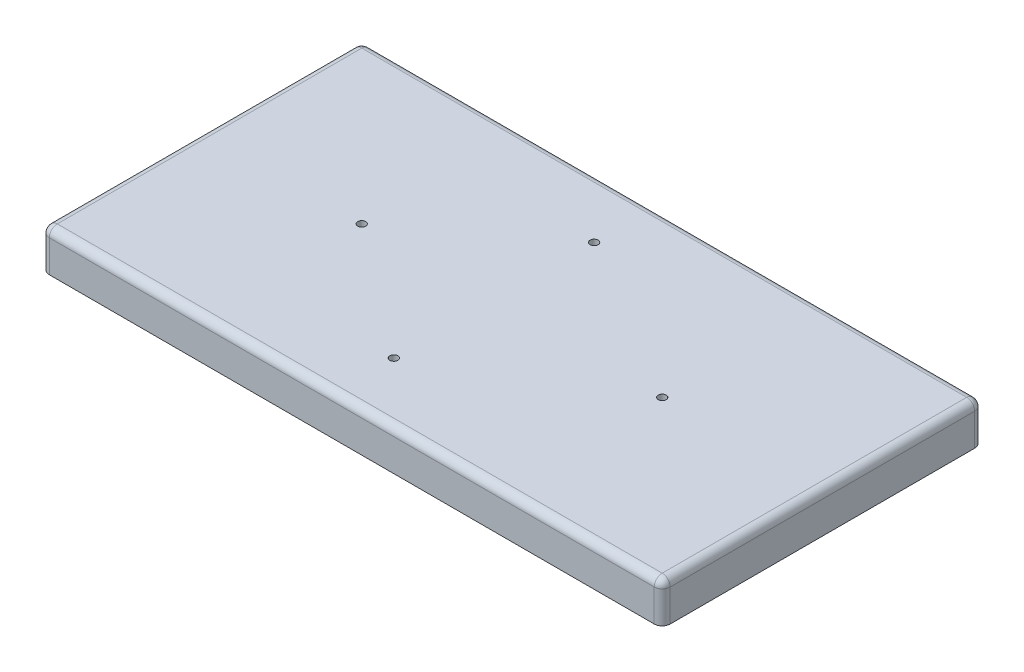
ISO-10303-21;
HEADER;
FILE_DESCRIPTION(('STEP AP214'),'2;1');
FILE_NAME('part.step','',(''),(''),'','','');
FILE_SCHEMA(('AUTOMOTIVE_DESIGN { 1 0 10303 214 1 1 1 1 }'));
ENDSEC;
DATA;
#1=APPLICATION_CONTEXT('core data for automotive mechanical design processes');
#2=APPLICATION_PROTOCOL_DEFINITION('international standard','automotive_design',2000,#1);
#3=PRODUCT_CONTEXT('',#1,'mechanical');
#4=PRODUCT('Part','Part','',(#3));
#5=PRODUCT_RELATED_PRODUCT_CATEGORY('part','',(#4));
#6=PRODUCT_DEFINITION_FORMATION('','',#4);
#7=PRODUCT_DEFINITION_CONTEXT('part definition',#1,'design');
#8=PRODUCT_DEFINITION('design','',#6,#7);
#9=PRODUCT_DEFINITION_SHAPE('','',#8);
#10=(LENGTH_UNIT() NAMED_UNIT(*) SI_UNIT(.MILLI.,.METRE.));
#11=(NAMED_UNIT(*) PLANE_ANGLE_UNIT() SI_UNIT($,.RADIAN.));
#12=(NAMED_UNIT(*) SI_UNIT($,.STERADIAN.) SOLID_ANGLE_UNIT());
#13=UNCERTAINTY_MEASURE_WITH_UNIT(LENGTH_MEASURE(1.E-05),#10,'distance_accuracy_value','');
#14=(GEOMETRIC_REPRESENTATION_CONTEXT(3) GLOBAL_UNCERTAINTY_ASSIGNED_CONTEXT((#13)) GLOBAL_UNIT_ASSIGNED_CONTEXT((#10,
#11,#12)) REPRESENTATION_CONTEXT('',''));
#15=CARTESIAN_POINT('',(0.,0.,0.));
#16=DIRECTION('',(0.,0.,1.));
#17=DIRECTION('',(1.,0.,0.));
#18=AXIS2_PLACEMENT_3D('',#15,#16,#17);
#19=CARTESIAN_POINT('',(0.,-5.,0.));
#20=DIRECTION('',(0.,-1.,0.));
#21=DIRECTION('',(0.,0.,-1.));
#22=AXIS2_PLACEMENT_3D('',#19,#20,#21);
#23=PLANE('',#22);
#24=CARTESIAN_POINT('',(73.,-5.,-15.));
#25=DIRECTION('',(0.,1.,0.));
#26=DIRECTION('',(0.,0.,1.));
#27=AXIS2_PLACEMENT_3D('',#24,#25,#26);
#28=CIRCLE('',#27,0.999999999999998);
#29=CARTESIAN_POINT('',(73.,-5.,-14.));
#30=VERTEX_POINT('',#29);
#31=EDGE_CURVE('E283',#30,#30,#28,.T.);
#32=ORIENTED_EDGE('',*,*,#31,.T.);
#33=EDGE_LOOP('',(#32));
#34=FACE_BOUND('',#33,.T.);
#35=CARTESIAN_POINT('',(73.,-5.,-65.));
#36=DIRECTION('',(0.,1.,0.));
#37=DIRECTION('',(0.,0.,1.));
#38=AXIS2_PLACEMENT_3D('',#35,#36,#37);
#39=CIRCLE('',#38,0.999999999999998);
#40=CARTESIAN_POINT('',(73.,-5.,-64.));
#41=VERTEX_POINT('',#40);
#42=EDGE_CURVE('E291',#41,#41,#39,.T.);
#43=ORIENTED_EDGE('',*,*,#42,.T.);
#44=EDGE_LOOP('',(#43));
#45=FACE_BOUND('',#44,.T.);
#46=CARTESIAN_POINT('',(115.,-5.,-40.));
#47=DIRECTION('',(0.,1.,0.));
#48=DIRECTION('',(0.,0.,1.));
#49=AXIS2_PLACEMENT_3D('',#46,#47,#48);
#50=CIRCLE('',#49,0.999999999999998);
#51=CARTESIAN_POINT('',(115.,-5.,-39.));
#52=VERTEX_POINT('',#51);
#53=EDGE_CURVE('E299',#52,#52,#50,.T.);
#54=ORIENTED_EDGE('',*,*,#53,.T.);
#55=EDGE_LOOP('',(#54));
#56=FACE_BOUND('',#55,.T.);
#57=CARTESIAN_POINT('',(40.,-5.,-40.));
#58=DIRECTION('',(0.,1.,0.));
#59=DIRECTION('',(0.,0.,1.));
#60=AXIS2_PLACEMENT_3D('',#57,#58,#59);
#61=CIRCLE('',#60,0.999999999999998);
#62=CARTESIAN_POINT('',(40.,-5.,-39.));
#63=VERTEX_POINT('',#62);
#64=EDGE_CURVE('E307',#63,#63,#61,.T.);
#65=ORIENTED_EDGE('',*,*,#64,.T.);
#66=EDGE_LOOP('',(#65));
#67=FACE_BOUND('',#66,.T.);
#68=DIRECTION('',(-1.,0.,0.));
#69=VECTOR('',#68,1.);
#70=CARTESIAN_POINT('',(0.,-5.,-5.));
#71=LINE('',#70,#69);
#72=CARTESIAN_POINT('',(150.,-5.,-5.));
#73=VERTEX_POINT('',#72);
#74=CARTESIAN_POINT('',(5.00000000000001,-5.,-5.));
#75=VERTEX_POINT('',#74);
#76=EDGE_CURVE('E223',#73,#75,#71,.T.);
#77=ORIENTED_EDGE('',*,*,#76,.T.);
#78=DIRECTION('',(0.,0.,-1.));
#79=VECTOR('',#78,1.);
#80=CARTESIAN_POINT('',(5.00000000000001,-5.,0.));
#81=LINE('',#80,#79);
#82=CARTESIAN_POINT('',(5.,-5.,-75.));
#83=VERTEX_POINT('',#82);
#84=EDGE_CURVE('E172',#75,#83,#81,.T.);
#85=ORIENTED_EDGE('',*,*,#84,.T.);
#86=DIRECTION('',(1.,0.,0.));
#87=VECTOR('',#86,1.);
#88=CARTESIAN_POINT('',(0.,-5.,-75.));
#89=LINE('',#88,#87);
#90=CARTESIAN_POINT('',(150.,-5.,-75.));
#91=VERTEX_POINT('',#90);
#92=EDGE_CURVE('E230',#83,#91,#89,.T.);
#93=ORIENTED_EDGE('',*,*,#92,.T.);
#94=DIRECTION('',(0.,0.,1.));
#95=VECTOR('',#94,1.);
#96=CARTESIAN_POINT('',(150.,-5.,0.));
#97=LINE('',#96,#95);
#98=EDGE_CURVE('E226',#91,#73,#97,.T.);
#99=ORIENTED_EDGE('',*,*,#98,.T.);
#100=EDGE_LOOP('',(#77,#85,#93,#99));
#101=FACE_BOUND('',#100,.T.);
#102=ADVANCED_FACE('F39',(#34,#45,#56,#67,#101),#23,.T.);
#103=CARTESIAN_POINT('',(3.,-10.,-77.));
#104=DIRECTION('',(-1.,0.,0.));
#105=DIRECTION('',(0.,0.,1.));
#106=AXIS2_PLACEMENT_3D('',#103,#104,#105);
#107=PLANE('',#106);
#108=DIRECTION('',(0.,0.,-1.));
#109=VECTOR('',#108,1.);
#110=CARTESIAN_POINT('',(3.,-7.,-77.));
#111=LINE('',#110,#109);
#112=CARTESIAN_POINT('',(3.00000000000001,-7.,-3.));
#113=VERTEX_POINT('',#112);
#114=CARTESIAN_POINT('',(3.,-7.,-77.));
#115=VERTEX_POINT('',#114);
#116=EDGE_CURVE('E219',#113,#115,#111,.T.);
#117=ORIENTED_EDGE('',*,*,#116,.F.);
#118=DIRECTION('',(0.,1.,0.));
#119=VECTOR('',#118,1.);
#120=CARTESIAN_POINT('',(3.00000000000001,-10.,-3.));
#121=LINE('',#120,#119);
#122=CARTESIAN_POINT('',(3.00000000000001,-10.,-3.));
#123=VERTEX_POINT('',#122);
#124=EDGE_CURVE('E252',#123,#113,#121,.T.);
#125=ORIENTED_EDGE('',*,*,#124,.F.);
#126=DIRECTION('',(0.,0.,1.));
#127=VECTOR('',#126,1.);
#128=CARTESIAN_POINT('',(3.,-10.,-77.));
#129=LINE('',#128,#127);
#130=CARTESIAN_POINT('',(3.,-10.,-77.));
#131=VERTEX_POINT('',#130);
#132=EDGE_CURVE('E236',#131,#123,#129,.T.);
#133=ORIENTED_EDGE('',*,*,#132,.F.);
#134=DIRECTION('',(0.,1.,0.));
#135=VECTOR('',#134,1.);
#136=CARTESIAN_POINT('',(3.,-10.,-77.));
#137=LINE('',#136,#135);
#138=EDGE_CURVE('E253',#131,#115,#137,.T.);
#139=ORIENTED_EDGE('',*,*,#138,.T.);
#140=EDGE_LOOP('',(#117,#125,#133,#139));
#141=FACE_BOUND('',#140,.T.);
#142=ADVANCED_FACE('F493',(#141),#107,.F.);
#143=CARTESIAN_POINT('',(3.,-10.,-77.));
#144=DIRECTION('',(0.,0.,-1.));
#145=DIRECTION('',(-1.,0.,0.));
#146=AXIS2_PLACEMENT_3D('',#143,#144,#145);
#147=PLANE('',#146);
#148=DIRECTION('',(1.,0.,0.));
#149=VECTOR('',#148,1.);
#150=CARTESIAN_POINT('',(3.,-7.,-77.));
#151=LINE('',#150,#149);
#152=CARTESIAN_POINT('',(152.,-7.,-77.));
#153=VERTEX_POINT('',#152);
#154=EDGE_CURVE('E215',#115,#153,#151,.T.);
#155=ORIENTED_EDGE('',*,*,#154,.F.);
#156=ORIENTED_EDGE('',*,*,#138,.F.);
#157=DIRECTION('',(-1.,0.,0.));
#158=VECTOR('',#157,1.);
#159=CARTESIAN_POINT('',(3.,-10.,-77.));
#160=LINE('',#159,#158);
#161=CARTESIAN_POINT('',(152.,-10.,-77.));
#162=VERTEX_POINT('',#161);
#163=EDGE_CURVE('E248',#162,#131,#160,.T.);
#164=ORIENTED_EDGE('',*,*,#163,.F.);
#165=DIRECTION('',(0.,1.,0.));
#166=VECTOR('',#165,1.);
#167=CARTESIAN_POINT('',(152.,-10.,-77.));
#168=LINE('',#167,#166);
#169=EDGE_CURVE('E258',#162,#153,#168,.T.);
#170=ORIENTED_EDGE('',*,*,#169,.T.);
#171=EDGE_LOOP('',(#155,#156,#164,#170));
#172=FACE_BOUND('',#171,.T.);
#173=ADVANCED_FACE('F499',(#172),#147,.F.);
#174=CARTESIAN_POINT('',(152.,-10.,-77.));
#175=DIRECTION('',(1.,0.,0.));
#176=DIRECTION('',(0.,0.,-1.));
#177=AXIS2_PLACEMENT_3D('',#174,#175,#176);
#178=PLANE('',#177);
#179=DIRECTION('',(0.,0.,1.));
#180=VECTOR('',#179,1.);
#181=CARTESIAN_POINT('',(152.,-7.,-77.));
#182=LINE('',#181,#180);
#183=CARTESIAN_POINT('',(152.,-7.,-3.));
#184=VERTEX_POINT('',#183);
#185=EDGE_CURVE('E205',#153,#184,#182,.T.);
#186=ORIENTED_EDGE('',*,*,#185,.F.);
#187=ORIENTED_EDGE('',*,*,#169,.F.);
#188=DIRECTION('',(0.,0.,-1.));
#189=VECTOR('',#188,1.);
#190=CARTESIAN_POINT('',(152.,-10.,-77.));
#191=LINE('',#190,#189);
#192=CARTESIAN_POINT('',(152.,-10.,-3.));
#193=VERTEX_POINT('',#192);
#194=EDGE_CURVE('E244',#193,#162,#191,.T.);
#195=ORIENTED_EDGE('',*,*,#194,.F.);
#196=DIRECTION('',(0.,1.,0.));
#197=VECTOR('',#196,1.);
#198=CARTESIAN_POINT('',(152.,-10.,-3.));
#199=LINE('',#198,#197);
#200=EDGE_CURVE('E262',#193,#184,#199,.T.);
#201=ORIENTED_EDGE('',*,*,#200,.T.);
#202=EDGE_LOOP('',(#186,#187,#195,#201));
#203=FACE_BOUND('',#202,.T.);
#204=ADVANCED_FACE('F514',(#203),#178,.F.);
#205=CARTESIAN_POINT('',(3.00000000000001,-10.,-3.));
#206=DIRECTION('',(0.,0.,1.));
#207=DIRECTION('',(1.,0.,0.));
#208=AXIS2_PLACEMENT_3D('',#205,#206,#207);
#209=PLANE('',#208);
#210=DIRECTION('',(-1.,0.,0.));
#211=VECTOR('',#210,1.);
#212=CARTESIAN_POINT('',(3.00000000000001,-7.,-3.));
#213=LINE('',#212,#211);
#214=EDGE_CURVE('E311',#184,#113,#213,.T.);
#215=ORIENTED_EDGE('',*,*,#214,.F.);
#216=ORIENTED_EDGE('',*,*,#200,.F.);
#217=DIRECTION('',(1.,0.,0.));
#218=VECTOR('',#217,1.);
#219=CARTESIAN_POINT('',(3.00000000000001,-10.,-3.));
#220=LINE('',#219,#218);
#221=EDGE_CURVE('E240',#123,#193,#220,.T.);
#222=ORIENTED_EDGE('',*,*,#221,.F.);
#223=ORIENTED_EDGE('',*,*,#124,.T.);
#224=EDGE_LOOP('',(#215,#216,#222,#223));
#225=FACE_BOUND('',#224,.T.);
#226=ADVANCED_FACE('F510',(#225),#209,.F.);
#227=CARTESIAN_POINT('',(0.,-5.,0.));
#228=DIRECTION('',(-1.,0.,0.));
#229=DIRECTION('',(0.,0.,1.));
#230=AXIS2_PLACEMENT_3D('',#227,#228,#229);
#231=PLANE('',#230);
#232=DIRECTION('',(0.,0.,1.));
#233=VECTOR('',#232,1.);
#234=CARTESIAN_POINT('',(0.,-2.,-80.));
#235=LINE('',#234,#233);
#236=CARTESIAN_POINT('',(0.,-2.,-2.));
#237=VERTEX_POINT('',#236);
#238=CARTESIAN_POINT('',(0.,-2.,-78.));
#239=VERTEX_POINT('',#238);
#240=EDGE_CURVE('E49',#237,#239,#235,.F.);
#241=ORIENTED_EDGE('',*,*,#240,.T.);
#242=DIRECTION('',(0.,1.,0.));
#243=VECTOR('',#242,1.);
#244=CARTESIAN_POINT('',(0.,-5.,-78.));
#245=LINE('',#244,#243);
#246=CARTESIAN_POINT('',(0.,-10.,-78.));
#247=VERTEX_POINT('',#246);
#248=EDGE_CURVE('E11',#239,#247,#245,.F.);
#249=ORIENTED_EDGE('',*,*,#248,.T.);
#250=DIRECTION('',(0.,0.,1.));
#251=VECTOR('',#250,1.);
#252=CARTESIAN_POINT('',(0.,-10.,-80.));
#253=LINE('',#252,#251);
#254=CARTESIAN_POINT('',(0.,-10.,-2.));
#255=VERTEX_POINT('',#254);
#256=EDGE_CURVE('E257',#247,#255,#253,.T.);
#257=ORIENTED_EDGE('',*,*,#256,.T.);
#258=DIRECTION('',(0.,1.,0.));
#259=VECTOR('',#258,1.);
#260=CARTESIAN_POINT('',(0.,-5.,-2.));
#261=LINE('',#260,#259);
#262=EDGE_CURVE('E60',#255,#237,#261,.T.);
#263=ORIENTED_EDGE('',*,*,#262,.T.);
#264=EDGE_LOOP('',(#241,#249,#257,#263));
#265=FACE_BOUND('',#264,.T.);
#266=ADVANCED_FACE('F429',(#265),#231,.T.);
#267=CARTESIAN_POINT('',(0.,-5.,-80.));
#268=DIRECTION('',(0.,0.,-1.));
#269=DIRECTION('',(-1.,0.,0.));
#270=AXIS2_PLACEMENT_3D('',#267,#268,#269);
#271=PLANE('',#270);
#272=DIRECTION('',(-1.,0.,0.));
#273=VECTOR('',#272,1.);
#274=CARTESIAN_POINT('',(155.,-2.,-80.));
#275=LINE('',#274,#273);
#276=CARTESIAN_POINT('',(2.,-2.,-80.));
#277=VERTEX_POINT('',#276);
#278=CARTESIAN_POINT('',(153.,-2.,-80.));
#279=VERTEX_POINT('',#278);
#280=EDGE_CURVE('E365',#277,#279,#275,.F.);
#281=ORIENTED_EDGE('',*,*,#280,.T.);
#282=DIRECTION('',(0.,1.,0.));
#283=VECTOR('',#282,1.);
#284=CARTESIAN_POINT('',(153.,-5.,-80.));
#285=LINE('',#284,#283);
#286=CARTESIAN_POINT('',(153.,-10.,-80.));
#287=VERTEX_POINT('',#286);
#288=EDGE_CURVE('E368',#279,#287,#285,.F.);
#289=ORIENTED_EDGE('',*,*,#288,.T.);
#290=DIRECTION('',(-1.,0.,0.));
#291=VECTOR('',#290,1.);
#292=CARTESIAN_POINT('',(0.,-10.,-80.));
#293=LINE('',#292,#291);
#294=CARTESIAN_POINT('',(2.,-10.,-80.));
#295=VERTEX_POINT('',#294);
#296=EDGE_CURVE('E278',#287,#295,#293,.T.);
#297=ORIENTED_EDGE('',*,*,#296,.T.);
#298=DIRECTION('',(0.,1.,0.));
#299=VECTOR('',#298,1.);
#300=CARTESIAN_POINT('',(2.,-5.,-80.));
#301=LINE('',#300,#299);
#302=EDGE_CURVE('E362',#295,#277,#301,.T.);
#303=ORIENTED_EDGE('',*,*,#302,.T.);
#304=EDGE_LOOP('',(#281,#289,#297,#303));
#305=FACE_BOUND('',#304,.T.);
#306=ADVANCED_FACE('F466',(#305),#271,.T.);
#307=CARTESIAN_POINT('',(155.,-5.,0.));
#308=DIRECTION('',(1.,0.,0.));
#309=DIRECTION('',(0.,0.,-1.));
#310=AXIS2_PLACEMENT_3D('',#307,#308,#309);
#311=PLANE('',#310);
#312=DIRECTION('',(0.,0.,-1.));
#313=VECTOR('',#312,1.);
#314=CARTESIAN_POINT('',(155.,-2.,0.));
#315=LINE('',#314,#313);
#316=CARTESIAN_POINT('',(155.,-2.,-78.));
#317=VERTEX_POINT('',#316);
#318=CARTESIAN_POINT('',(155.,-2.,-2.));
#319=VERTEX_POINT('',#318);
#320=EDGE_CURVE('E331',#317,#319,#315,.F.);
#321=ORIENTED_EDGE('',*,*,#320,.T.);
#322=DIRECTION('',(0.,1.,0.));
#323=VECTOR('',#322,1.);
#324=CARTESIAN_POINT('',(155.,-5.,-2.));
#325=LINE('',#324,#323);
#326=CARTESIAN_POINT('',(155.,-10.,-2.));
#327=VERTEX_POINT('',#326);
#328=EDGE_CURVE('E334',#319,#327,#325,.F.);
#329=ORIENTED_EDGE('',*,*,#328,.T.);
#330=DIRECTION('',(0.,0.,-1.));
#331=VECTOR('',#330,1.);
#332=CARTESIAN_POINT('',(155.,-10.,-80.));
#333=LINE('',#332,#331);
#334=CARTESIAN_POINT('',(155.,-10.,-78.));
#335=VERTEX_POINT('',#334);
#336=EDGE_CURVE('E274',#327,#335,#333,.T.);
#337=ORIENTED_EDGE('',*,*,#336,.T.);
#338=DIRECTION('',(0.,1.,0.));
#339=VECTOR('',#338,1.);
#340=CARTESIAN_POINT('',(155.,-5.,-78.));
#341=LINE('',#340,#339);
#342=EDGE_CURVE('E328',#335,#317,#341,.T.);
#343=ORIENTED_EDGE('',*,*,#342,.T.);
#344=EDGE_LOOP('',(#321,#329,#337,#343));
#345=FACE_BOUND('',#344,.T.);
#346=ADVANCED_FACE('F473',(#345),#311,.T.);
#347=CARTESIAN_POINT('',(0.,-5.,0.));
#348=DIRECTION('',(0.,0.,1.));
#349=DIRECTION('',(1.,0.,0.));
#350=AXIS2_PLACEMENT_3D('',#347,#348,#349);
#351=PLANE('',#350);
#352=DIRECTION('',(1.,0.,0.));
#353=VECTOR('',#352,1.);
#354=CARTESIAN_POINT('',(0.,-10.,0.));
#355=LINE('',#354,#353);
#356=CARTESIAN_POINT('',(2.,-10.,0.));
#357=VERTEX_POINT('',#356);
#358=CARTESIAN_POINT('',(153.,-10.,0.));
#359=VERTEX_POINT('',#358);
#360=EDGE_CURVE('E270',#357,#359,#355,.T.);
#361=ORIENTED_EDGE('',*,*,#360,.T.);
#362=DIRECTION('',(0.,1.,0.));
#363=VECTOR('',#362,1.);
#364=CARTESIAN_POINT('',(153.,-5.,0.));
#365=LINE('',#364,#363);
#366=CARTESIAN_POINT('',(153.,-2.,0.));
#367=VERTEX_POINT('',#366);
#368=EDGE_CURVE('E324',#359,#367,#365,.T.);
#369=ORIENTED_EDGE('',*,*,#368,.T.);
#370=DIRECTION('',(1.,0.,0.));
#371=VECTOR('',#370,1.);
#372=CARTESIAN_POINT('',(0.,-2.,0.));
#373=LINE('',#372,#371);
#374=CARTESIAN_POINT('',(2.,-2.,0.));
#375=VERTEX_POINT('',#374);
#376=EDGE_CURVE('E318',#367,#375,#373,.F.);
#377=ORIENTED_EDGE('',*,*,#376,.T.);
#378=DIRECTION('',(0.,1.,0.));
#379=VECTOR('',#378,1.);
#380=CARTESIAN_POINT('',(2.,-5.,0.));
#381=LINE('',#380,#379);
#382=EDGE_CURVE('E321',#375,#357,#381,.F.);
#383=ORIENTED_EDGE('',*,*,#382,.T.);
#384=EDGE_LOOP('',(#361,#369,#377,#383));
#385=FACE_BOUND('',#384,.T.);
#386=ADVANCED_FACE('F481',(#385),#351,.T.);
#387=CARTESIAN_POINT('',(0.,0.,0.));
#388=DIRECTION('',(0.,-1.,0.));
#389=DIRECTION('',(0.,0.,-1.));
#390=AXIS2_PLACEMENT_3D('',#387,#388,#389);
#391=PLANE('',#390);
#392=DIRECTION('',(1.,0.,0.));
#393=VECTOR('',#392,1.);
#394=CARTESIAN_POINT('',(155.,0.,-2.));
#395=LINE('',#394,#393);
#396=CARTESIAN_POINT('',(2.,0.,-2.));
#397=VERTEX_POINT('',#396);
#398=CARTESIAN_POINT('',(153.,0.,-2.));
#399=VERTEX_POINT('',#398);
#400=EDGE_CURVE('E349',#397,#399,#395,.T.);
#401=ORIENTED_EDGE('',*,*,#400,.T.);
#402=DIRECTION('',(0.,0.,-1.));
#403=VECTOR('',#402,1.);
#404=CARTESIAN_POINT('',(153.,0.,-80.));
#405=LINE('',#404,#403);
#406=CARTESIAN_POINT('',(153.,0.,-78.));
#407=VERTEX_POINT('',#406);
#408=EDGE_CURVE('E358',#399,#407,#405,.T.);
#409=ORIENTED_EDGE('',*,*,#408,.T.);
#410=DIRECTION('',(-1.,0.,0.));
#411=VECTOR('',#410,1.);
#412=CARTESIAN_POINT('',(0.,0.,-78.));
#413=LINE('',#412,#411);
#414=CARTESIAN_POINT('',(2.,0.,-78.));
#415=VERTEX_POINT('',#414);
#416=EDGE_CURVE('E355',#407,#415,#413,.T.);
#417=ORIENTED_EDGE('',*,*,#416,.T.);
#418=DIRECTION('',(0.,0.,1.));
#419=VECTOR('',#418,1.);
#420=CARTESIAN_POINT('',(2.,0.,0.));
#421=LINE('',#420,#419);
#422=EDGE_CURVE('E352',#415,#397,#421,.T.);
#423=ORIENTED_EDGE('',*,*,#422,.T.);
#424=EDGE_LOOP('',(#401,#409,#417,#423));
#425=FACE_BOUND('',#424,.T.);
#426=CARTESIAN_POINT('',(73.,0.,-15.));
#427=DIRECTION('',(0.,1.,0.));
#428=DIRECTION('',(0.,0.,1.));
#429=AXIS2_PLACEMENT_3D('',#426,#427,#428);
#430=CIRCLE('',#429,0.999999999999998);
#431=CARTESIAN_POINT('',(73.,0.,-14.));
#432=VERTEX_POINT('',#431);
#433=EDGE_CURVE('E282',#432,#432,#430,.T.);
#434=ORIENTED_EDGE('',*,*,#433,.F.);
#435=EDGE_LOOP('',(#434));
#436=FACE_BOUND('',#435,.T.);
#437=CARTESIAN_POINT('',(73.,0.,-65.));
#438=DIRECTION('',(0.,1.,0.));
#439=DIRECTION('',(0.,0.,1.));
#440=AXIS2_PLACEMENT_3D('',#437,#438,#439);
#441=CIRCLE('',#440,0.999999999999998);
#442=CARTESIAN_POINT('',(73.,0.,-64.));
#443=VERTEX_POINT('',#442);
#444=EDGE_CURVE('E287',#443,#443,#441,.T.);
#445=ORIENTED_EDGE('',*,*,#444,.F.);
#446=EDGE_LOOP('',(#445));
#447=FACE_BOUND('',#446,.T.);
#448=CARTESIAN_POINT('',(115.,0.,-40.));
#449=DIRECTION('',(0.,1.,0.));
#450=DIRECTION('',(0.,0.,1.));
#451=AXIS2_PLACEMENT_3D('',#448,#449,#450);
#452=CIRCLE('',#451,0.999999999999998);
#453=CARTESIAN_POINT('',(115.,0.,-39.));
#454=VERTEX_POINT('',#453);
#455=EDGE_CURVE('E295',#454,#454,#452,.T.);
#456=ORIENTED_EDGE('',*,*,#455,.F.);
#457=EDGE_LOOP('',(#456));
#458=FACE_BOUND('',#457,.T.);
#459=CARTESIAN_POINT('',(40.,0.,-40.));
#460=DIRECTION('',(0.,1.,0.));
#461=DIRECTION('',(0.,0.,1.));
#462=AXIS2_PLACEMENT_3D('',#459,#460,#461);
#463=CIRCLE('',#462,0.999999999999998);
#464=CARTESIAN_POINT('',(40.,0.,-39.));
#465=VERTEX_POINT('',#464);
#466=EDGE_CURVE('E303',#465,#465,#463,.T.);
#467=ORIENTED_EDGE('',*,*,#466,.F.);
#468=EDGE_LOOP('',(#467));
#469=FACE_BOUND('',#468,.T.);
#470=ADVANCED_FACE('F449',(#425,#436,#447,#458,#469),#391,.F.);
#471=CARTESIAN_POINT('',(40.,-5.,-40.));
#472=DIRECTION('',(0.,1.,0.));
#473=DIRECTION('',(0.,0.,1.));
#474=AXIS2_PLACEMENT_3D('',#471,#472,#473);
#475=CYLINDRICAL_SURFACE('',#474,0.999999999999998);
#476=ORIENTED_EDGE('',*,*,#64,.F.);
#477=EDGE_LOOP('',(#476));
#478=FACE_BOUND('',#477,.T.);
#479=ORIENTED_EDGE('',*,*,#466,.T.);
#480=EDGE_LOOP('',(#479));
#481=FACE_BOUND('',#480,.T.);
#482=ADVANCED_FACE('F488',(#478,#481),#475,.F.);
#483=CARTESIAN_POINT('',(115.,-5.,-40.));
#484=DIRECTION('',(0.,1.,0.));
#485=DIRECTION('',(0.,0.,1.));
#486=AXIS2_PLACEMENT_3D('',#483,#484,#485);
#487=CYLINDRICAL_SURFACE('',#486,0.999999999999998);
#488=ORIENTED_EDGE('',*,*,#53,.F.);
#489=EDGE_LOOP('',(#488));
#490=FACE_BOUND('',#489,.T.);
#491=ORIENTED_EDGE('',*,*,#455,.T.);
#492=EDGE_LOOP('',(#491));
#493=FACE_BOUND('',#492,.T.);
#494=ADVANCED_FACE('F573',(#490,#493),#487,.F.);
#495=CARTESIAN_POINT('',(73.,-5.,-65.));
#496=DIRECTION('',(0.,1.,0.));
#497=DIRECTION('',(0.,0.,1.));
#498=AXIS2_PLACEMENT_3D('',#495,#496,#497);
#499=CYLINDRICAL_SURFACE('',#498,0.999999999999998);
#500=ORIENTED_EDGE('',*,*,#42,.F.);
#501=EDGE_LOOP('',(#500));
#502=FACE_BOUND('',#501,.T.);
#503=ORIENTED_EDGE('',*,*,#444,.T.);
#504=EDGE_LOOP('',(#503));
#505=FACE_BOUND('',#504,.T.);
#506=ADVANCED_FACE('F570',(#502,#505),#499,.F.);
#507=CARTESIAN_POINT('',(73.,-5.,-15.));
#508=DIRECTION('',(0.,1.,0.));
#509=DIRECTION('',(0.,0.,1.));
#510=AXIS2_PLACEMENT_3D('',#507,#508,#509);
#511=CYLINDRICAL_SURFACE('',#510,0.999999999999998);
#512=ORIENTED_EDGE('',*,*,#31,.F.);
#513=EDGE_LOOP('',(#512));
#514=FACE_BOUND('',#513,.T.);
#515=ORIENTED_EDGE('',*,*,#433,.T.);
#516=EDGE_LOOP('',(#515));
#517=FACE_BOUND('',#516,.T.);
#518=ADVANCED_FACE('F566',(#514,#517),#511,.F.);
#519=CARTESIAN_POINT('',(0.,-10.,0.));
#520=DIRECTION('',(0.,1.,0.));
#521=DIRECTION('',(0.,0.,1.));
#522=AXIS2_PLACEMENT_3D('',#519,#520,#521);
#523=PLANE('',#522);
#524=ORIENTED_EDGE('',*,*,#163,.T.);
#525=ORIENTED_EDGE('',*,*,#132,.T.);
#526=ORIENTED_EDGE('',*,*,#221,.T.);
#527=ORIENTED_EDGE('',*,*,#194,.T.);
#528=EDGE_LOOP('',(#524,#525,#526,#527));
#529=FACE_BOUND('',#528,.T.);
#530=ORIENTED_EDGE('',*,*,#336,.F.);
#531=CARTESIAN_POINT('',(153.,-10.,-2.));
#532=DIRECTION('',(0.,1.,0.));
#533=DIRECTION('',(0.,0.,1.));
#534=AXIS2_PLACEMENT_3D('',#531,#532,#533);
#535=CIRCLE('',#534,2.);
#536=EDGE_CURVE('E346',#327,#359,#535,.F.);
#537=ORIENTED_EDGE('',*,*,#536,.T.);
#538=ORIENTED_EDGE('',*,*,#360,.F.);
#539=CARTESIAN_POINT('',(2.,-10.,-2.));
#540=DIRECTION('',(0.,1.,0.));
#541=DIRECTION('',(0.,0.,1.));
#542=AXIS2_PLACEMENT_3D('',#539,#540,#541);
#543=CIRCLE('',#542,2.);
#544=EDGE_CURVE('E337',#357,#255,#543,.F.);
#545=ORIENTED_EDGE('',*,*,#544,.T.);
#546=ORIENTED_EDGE('',*,*,#256,.F.);
#547=CARTESIAN_POINT('',(2.,-10.,-78.));
#548=DIRECTION('',(0.,1.,0.));
#549=DIRECTION('',(0.,0.,1.));
#550=AXIS2_PLACEMENT_3D('',#547,#548,#549);
#551=CIRCLE('',#550,2.);
#552=EDGE_CURVE('E340',#247,#295,#551,.F.);
#553=ORIENTED_EDGE('',*,*,#552,.T.);
#554=ORIENTED_EDGE('',*,*,#296,.F.);
#555=CARTESIAN_POINT('',(153.,-10.,-78.));
#556=DIRECTION('',(0.,1.,0.));
#557=DIRECTION('',(0.,0.,1.));
#558=AXIS2_PLACEMENT_3D('',#555,#556,#557);
#559=CIRCLE('',#558,2.);
#560=EDGE_CURVE('E343',#287,#335,#559,.F.);
#561=ORIENTED_EDGE('',*,*,#560,.T.);
#562=EDGE_LOOP('',(#530,#537,#538,#545,#546,#553,#554,#561));
#563=FACE_BOUND('',#562,.T.);
#564=ADVANCED_FACE('F432',(#529,#563),#523,.F.);
#565=CARTESIAN_POINT('',(0.,-7.,0.));
#566=DIRECTION('',(0.,1.,0.));
#567=DIRECTION('',(0.,0.,1.));
#568=AXIS2_PLACEMENT_3D('',#565,#566,#567);
#569=PLANE('',#568);
#570=DIRECTION('',(-1.,0.,0.));
#571=VECTOR('',#570,1.);
#572=CARTESIAN_POINT('',(5.,-7.,-75.));
#573=LINE('',#572,#571);
#574=CARTESIAN_POINT('',(150.,-7.,-75.));
#575=VERTEX_POINT('',#574);
#576=CARTESIAN_POINT('',(5.,-7.,-75.));
#577=VERTEX_POINT('',#576);
#578=EDGE_CURVE('E177',#575,#577,#573,.T.);
#579=ORIENTED_EDGE('',*,*,#578,.T.);
#580=DIRECTION('',(0.,0.,1.));
#581=VECTOR('',#580,1.);
#582=CARTESIAN_POINT('',(5.,-7.,-75.));
#583=LINE('',#582,#581);
#584=CARTESIAN_POINT('',(5.00000000000001,-7.,-5.));
#585=VERTEX_POINT('',#584);
#586=EDGE_CURVE('E169',#577,#585,#583,.T.);
#587=ORIENTED_EDGE('',*,*,#586,.T.);
#588=DIRECTION('',(1.,0.,0.));
#589=VECTOR('',#588,1.);
#590=CARTESIAN_POINT('',(5.00000000000001,-7.,-5.));
#591=LINE('',#590,#589);
#592=CARTESIAN_POINT('',(150.,-7.,-5.));
#593=VERTEX_POINT('',#592);
#594=EDGE_CURVE('E181',#585,#593,#591,.T.);
#595=ORIENTED_EDGE('',*,*,#594,.T.);
#596=DIRECTION('',(0.,0.,-1.));
#597=VECTOR('',#596,1.);
#598=CARTESIAN_POINT('',(150.,-7.,-75.));
#599=LINE('',#598,#597);
#600=EDGE_CURVE('E187',#593,#575,#599,.T.);
#601=ORIENTED_EDGE('',*,*,#600,.T.);
#602=EDGE_LOOP('',(#579,#587,#595,#601));
#603=FACE_BOUND('',#602,.T.);
#604=ORIENTED_EDGE('',*,*,#214,.T.);
#605=ORIENTED_EDGE('',*,*,#116,.T.);
#606=ORIENTED_EDGE('',*,*,#154,.T.);
#607=ORIENTED_EDGE('',*,*,#185,.T.);
#608=EDGE_LOOP('',(#604,#605,#606,#607));
#609=FACE_BOUND('',#608,.T.);
#610=ADVANCED_FACE('F189',(#603,#609),#569,.F.);
#611=CARTESIAN_POINT('',(5.,-7.,-75.));
#612=DIRECTION('',(-1.,0.,0.));
#613=DIRECTION('',(0.,0.,1.));
#614=AXIS2_PLACEMENT_3D('',#611,#612,#613);
#615=PLANE('',#614);
#616=ORIENTED_EDGE('',*,*,#84,.F.);
#617=DIRECTION('',(0.,1.,0.));
#618=VECTOR('',#617,1.);
#619=CARTESIAN_POINT('',(5.00000000000001,-7.,-5.));
#620=LINE('',#619,#618);
#621=EDGE_CURVE('E164',#585,#75,#620,.T.);
#622=ORIENTED_EDGE('',*,*,#621,.F.);
#623=ORIENTED_EDGE('',*,*,#586,.F.);
#624=DIRECTION('',(0.,1.,0.));
#625=VECTOR('',#624,1.);
#626=CARTESIAN_POINT('',(5.,-7.,-75.));
#627=LINE('',#626,#625);
#628=EDGE_CURVE('E202',#577,#83,#627,.T.);
#629=ORIENTED_EDGE('',*,*,#628,.T.);
#630=EDGE_LOOP('',(#616,#622,#623,#629));
#631=FACE_BOUND('',#630,.T.);
#632=ADVANCED_FACE('F166',(#631),#615,.F.);
#633=CARTESIAN_POINT('',(5.,-7.,-75.));
#634=DIRECTION('',(0.,0.,-1.));
#635=DIRECTION('',(-1.,0.,0.));
#636=AXIS2_PLACEMENT_3D('',#633,#634,#635);
#637=PLANE('',#636);
#638=ORIENTED_EDGE('',*,*,#92,.F.);
#639=ORIENTED_EDGE('',*,*,#628,.F.);
#640=ORIENTED_EDGE('',*,*,#578,.F.);
#641=DIRECTION('',(0.,1.,0.));
#642=VECTOR('',#641,1.);
#643=CARTESIAN_POINT('',(150.,-7.,-75.));
#644=LINE('',#643,#642);
#645=EDGE_CURVE('E206',#575,#91,#644,.T.);
#646=ORIENTED_EDGE('',*,*,#645,.T.);
#647=EDGE_LOOP('',(#638,#639,#640,#646));
#648=FACE_BOUND('',#647,.T.);
#649=ADVANCED_FACE('F549',(#648),#637,.F.);
#650=CARTESIAN_POINT('',(150.,-7.,-75.));
#651=DIRECTION('',(1.,0.,0.));
#652=DIRECTION('',(0.,0.,-1.));
#653=AXIS2_PLACEMENT_3D('',#650,#651,#652);
#654=PLANE('',#653);
#655=ORIENTED_EDGE('',*,*,#98,.F.);
#656=ORIENTED_EDGE('',*,*,#645,.F.);
#657=ORIENTED_EDGE('',*,*,#600,.F.);
#658=DIRECTION('',(0.,1.,0.));
#659=VECTOR('',#658,1.);
#660=CARTESIAN_POINT('',(150.,-7.,-5.));
#661=LINE('',#660,#659);
#662=EDGE_CURVE('E176',#593,#73,#661,.T.);
#663=ORIENTED_EDGE('',*,*,#662,.T.);
#664=EDGE_LOOP('',(#655,#656,#657,#663));
#665=FACE_BOUND('',#664,.T.);
#666=ADVANCED_FACE('F544',(#665),#654,.F.);
#667=CARTESIAN_POINT('',(5.00000000000001,-7.,-5.));
#668=DIRECTION('',(0.,0.,1.));
#669=DIRECTION('',(1.,0.,0.));
#670=AXIS2_PLACEMENT_3D('',#667,#668,#669);
#671=PLANE('',#670);
#672=ORIENTED_EDGE('',*,*,#76,.F.);
#673=ORIENTED_EDGE('',*,*,#662,.F.);
#674=ORIENTED_EDGE('',*,*,#594,.F.);
#675=ORIENTED_EDGE('',*,*,#621,.T.);
#676=EDGE_LOOP('',(#672,#673,#674,#675));
#677=FACE_BOUND('',#676,.T.);
#678=ADVANCED_FACE('F182',(#677),#671,.F.);
#679=CARTESIAN_POINT('',(2.,-5.,-78.));
#680=DIRECTION('',(0.,1.,0.));
#681=DIRECTION('',(0.,0.,1.));
#682=AXIS2_PLACEMENT_3D('',#679,#680,#681);
#683=CYLINDRICAL_SURFACE('',#682,2.);
#684=CARTESIAN_POINT('',(2.,-2.,-78.));
#685=DIRECTION('',(0.,1.,0.));
#686=DIRECTION('',(0.,0.,1.));
#687=AXIS2_PLACEMENT_3D('',#684,#685,#686);
#688=CIRCLE('',#687,2.);
#689=EDGE_CURVE('E43',#277,#239,#688,.T.);
#690=ORIENTED_EDGE('',*,*,#689,.F.);
#691=ORIENTED_EDGE('',*,*,#302,.F.);
#692=ORIENTED_EDGE('',*,*,#552,.F.);
#693=ORIENTED_EDGE('',*,*,#248,.F.);
#694=EDGE_LOOP('',(#690,#691,#692,#693));
#695=FACE_BOUND('',#694,.T.);
#696=ADVANCED_FACE('F41',(#695),#683,.T.);
#697=CARTESIAN_POINT('',(2.,-2.,-78.));
#698=DIRECTION('',(-1.,0.,0.));
#699=DIRECTION('',(0.,0.,1.));
#700=AXIS2_PLACEMENT_3D('',#697,#698,#699);
#701=SPHERICAL_SURFACE('',#700,2.);
#702=CARTESIAN_POINT('',(2.,-2.,-78.));
#703=DIRECTION('',(-1.,0.,0.));
#704=DIRECTION('',(0.,0.,1.));
#705=AXIS2_PLACEMENT_3D('',#702,#703,#704);
#706=CIRCLE('',#705,2.);
#707=EDGE_CURVE('E409',#277,#415,#706,.F.);
#708=ORIENTED_EDGE('',*,*,#707,.F.);
#709=ORIENTED_EDGE('',*,*,#689,.T.);
#710=CARTESIAN_POINT('',(2.,-2.,-78.));
#711=DIRECTION('',(0.,0.,-1.));
#712=DIRECTION('',(-1.,0.,0.));
#713=AXIS2_PLACEMENT_3D('',#710,#711,#712);
#714=CIRCLE('',#713,2.);
#715=EDGE_CURVE('E196',#415,#239,#714,.F.);
#716=ORIENTED_EDGE('',*,*,#715,.F.);
#717=EDGE_LOOP('',(#708,#709,#716));
#718=FACE_BOUND('',#717,.T.);
#719=ADVANCED_FACE('F422',(#718),#701,.T.);
#720=CARTESIAN_POINT('',(2.,-5.,-2.));
#721=DIRECTION('',(0.,1.,0.));
#722=DIRECTION('',(0.,0.,1.));
#723=AXIS2_PLACEMENT_3D('',#720,#721,#722);
#724=CYLINDRICAL_SURFACE('',#723,2.);
#725=ORIENTED_EDGE('',*,*,#544,.F.);
#726=ORIENTED_EDGE('',*,*,#382,.F.);
#727=CARTESIAN_POINT('',(2.,-2.,-2.));
#728=DIRECTION('',(0.,1.,0.));
#729=DIRECTION('',(0.,0.,1.));
#730=AXIS2_PLACEMENT_3D('',#727,#728,#729);
#731=CIRCLE('',#730,2.);
#732=EDGE_CURVE('E405',#237,#375,#731,.T.);
#733=ORIENTED_EDGE('',*,*,#732,.F.);
#734=ORIENTED_EDGE('',*,*,#262,.F.);
#735=EDGE_LOOP('',(#725,#726,#733,#734));
#736=FACE_BOUND('',#735,.T.);
#737=ADVANCED_FACE('F438',(#736),#724,.T.);
#738=CARTESIAN_POINT('',(2.,-2.,0.));
#739=DIRECTION('',(0.,0.,-1.));
#740=DIRECTION('',(-1.,0.,0.));
#741=AXIS2_PLACEMENT_3D('',#738,#739,#740);
#742=CYLINDRICAL_SURFACE('',#741,2.);
#743=ORIENTED_EDGE('',*,*,#715,.T.);
#744=ORIENTED_EDGE('',*,*,#240,.F.);
#745=CARTESIAN_POINT('',(2.,-2.,-2.));
#746=DIRECTION('',(0.,0.,1.));
#747=DIRECTION('',(1.,0.,0.));
#748=AXIS2_PLACEMENT_3D('',#745,#746,#747);
#749=CIRCLE('',#748,2.);
#750=EDGE_CURVE('E401',#397,#237,#749,.T.);
#751=ORIENTED_EDGE('',*,*,#750,.F.);
#752=ORIENTED_EDGE('',*,*,#422,.F.);
#753=EDGE_LOOP('',(#743,#744,#751,#752));
#754=FACE_BOUND('',#753,.T.);
#755=ADVANCED_FACE('F417',(#754),#742,.T.);
#756=CARTESIAN_POINT('',(0.,-2.,-78.));
#757=DIRECTION('',(1.,0.,0.));
#758=DIRECTION('',(0.,0.,-1.));
#759=AXIS2_PLACEMENT_3D('',#756,#757,#758);
#760=CYLINDRICAL_SURFACE('',#759,2.);
#761=ORIENTED_EDGE('',*,*,#707,.T.);
#762=ORIENTED_EDGE('',*,*,#416,.F.);
#763=CARTESIAN_POINT('',(153.,-2.,-78.));
#764=DIRECTION('',(1.,0.,0.));
#765=DIRECTION('',(0.,0.,-1.));
#766=AXIS2_PLACEMENT_3D('',#763,#764,#765);
#767=CIRCLE('',#766,2.);
#768=EDGE_CURVE('E397',#279,#407,#767,.T.);
#769=ORIENTED_EDGE('',*,*,#768,.F.);
#770=ORIENTED_EDGE('',*,*,#280,.F.);
#771=EDGE_LOOP('',(#761,#762,#769,#770));
#772=FACE_BOUND('',#771,.T.);
#773=ADVANCED_FACE('F463',(#772),#760,.T.);
#774=CARTESIAN_POINT('',(153.,-5.,-78.));
#775=DIRECTION('',(0.,1.,0.));
#776=DIRECTION('',(0.,0.,1.));
#777=AXIS2_PLACEMENT_3D('',#774,#775,#776);
#778=CYLINDRICAL_SURFACE('',#777,2.);
#779=ORIENTED_EDGE('',*,*,#560,.F.);
#780=ORIENTED_EDGE('',*,*,#288,.F.);
#781=CARTESIAN_POINT('',(153.,-2.,-78.));
#782=DIRECTION('',(0.,1.,0.));
#783=DIRECTION('',(0.,0.,1.));
#784=AXIS2_PLACEMENT_3D('',#781,#782,#783);
#785=CIRCLE('',#784,2.);
#786=EDGE_CURVE('E393',#317,#279,#785,.T.);
#787=ORIENTED_EDGE('',*,*,#786,.F.);
#788=ORIENTED_EDGE('',*,*,#342,.F.);
#789=EDGE_LOOP('',(#779,#780,#787,#788));
#790=FACE_BOUND('',#789,.T.);
#791=ADVANCED_FACE('F469',(#790),#778,.T.);
#792=CARTESIAN_POINT('',(2.,-2.,-2.));
#793=DIRECTION('',(-1.,0.,0.));
#794=DIRECTION('',(0.,0.,1.));
#795=AXIS2_PLACEMENT_3D('',#792,#793,#794);
#796=SPHERICAL_SURFACE('',#795,2.);
#797=ORIENTED_EDGE('',*,*,#750,.T.);
#798=ORIENTED_EDGE('',*,*,#732,.T.);
#799=CARTESIAN_POINT('',(2.,-2.,-2.));
#800=DIRECTION('',(-1.,0.,0.));
#801=DIRECTION('',(0.,0.,1.));
#802=AXIS2_PLACEMENT_3D('',#799,#800,#801);
#803=CIRCLE('',#802,2.);
#804=EDGE_CURVE('E389',#397,#375,#803,.F.);
#805=ORIENTED_EDGE('',*,*,#804,.F.);
#806=EDGE_LOOP('',(#797,#798,#805));
#807=FACE_BOUND('',#806,.T.);
#808=ADVANCED_FACE('F441',(#807),#796,.T.);
#809=CARTESIAN_POINT('',(153.,-2.,-78.));
#810=DIRECTION('',(0.,0.,-1.));
#811=DIRECTION('',(-1.,0.,0.));
#812=AXIS2_PLACEMENT_3D('',#809,#810,#811);
#813=SPHERICAL_SURFACE('',#812,2.);
#814=ORIENTED_EDGE('',*,*,#786,.T.);
#815=ORIENTED_EDGE('',*,*,#768,.T.);
#816=CARTESIAN_POINT('',(153.,-2.,-78.));
#817=DIRECTION('',(0.,0.,-1.));
#818=DIRECTION('',(-1.,0.,0.));
#819=AXIS2_PLACEMENT_3D('',#816,#817,#818);
#820=CIRCLE('',#819,2.);
#821=EDGE_CURVE('E386',#317,#407,#820,.F.);
#822=ORIENTED_EDGE('',*,*,#821,.F.);
#823=EDGE_LOOP('',(#814,#815,#822));
#824=FACE_BOUND('',#823,.T.);
#825=ADVANCED_FACE('F460',(#824),#813,.T.);
#826=CARTESIAN_POINT('',(0.,-2.,-2.));
#827=DIRECTION('',(-1.,0.,0.));
#828=DIRECTION('',(0.,0.,1.));
#829=AXIS2_PLACEMENT_3D('',#826,#827,#828);
#830=CYLINDRICAL_SURFACE('',#829,2.);
#831=ORIENTED_EDGE('',*,*,#804,.T.);
#832=ORIENTED_EDGE('',*,*,#376,.F.);
#833=CARTESIAN_POINT('',(153.,-2.,-2.));
#834=DIRECTION('',(1.,0.,0.));
#835=DIRECTION('',(0.,0.,-1.));
#836=AXIS2_PLACEMENT_3D('',#833,#834,#835);
#837=CIRCLE('',#836,2.);
#838=EDGE_CURVE('E382',#399,#367,#837,.T.);
#839=ORIENTED_EDGE('',*,*,#838,.F.);
#840=ORIENTED_EDGE('',*,*,#400,.F.);
#841=EDGE_LOOP('',(#831,#832,#839,#840));
#842=FACE_BOUND('',#841,.T.);
#843=ADVANCED_FACE('F446',(#842),#830,.T.);
#844=CARTESIAN_POINT('',(153.,-2.,0.));
#845=DIRECTION('',(0.,0.,1.));
#846=DIRECTION('',(1.,0.,0.));
#847=AXIS2_PLACEMENT_3D('',#844,#845,#846);
#848=CYLINDRICAL_SURFACE('',#847,2.);
#849=ORIENTED_EDGE('',*,*,#821,.T.);
#850=ORIENTED_EDGE('',*,*,#408,.F.);
#851=CARTESIAN_POINT('',(153.,-2.,-2.));
#852=DIRECTION('',(0.,0.,1.));
#853=DIRECTION('',(1.,0.,0.));
#854=AXIS2_PLACEMENT_3D('',#851,#852,#853);
#855=CIRCLE('',#854,2.);
#856=EDGE_CURVE('E378',#319,#399,#855,.T.);
#857=ORIENTED_EDGE('',*,*,#856,.F.);
#858=ORIENTED_EDGE('',*,*,#320,.F.);
#859=EDGE_LOOP('',(#849,#850,#857,#858));
#860=FACE_BOUND('',#859,.T.);
#861=ADVANCED_FACE('F453',(#860),#848,.T.);
#862=CARTESIAN_POINT('',(153.,-2.,-2.));
#863=DIRECTION('',(0.,1.,0.));
#864=DIRECTION('',(0.,0.,1.));
#865=AXIS2_PLACEMENT_3D('',#862,#863,#864);
#866=SPHERICAL_SURFACE('',#865,2.);
#867=ORIENTED_EDGE('',*,*,#856,.T.);
#868=ORIENTED_EDGE('',*,*,#838,.T.);
#869=CARTESIAN_POINT('',(153.,-2.,-2.));
#870=DIRECTION('',(0.,1.,0.));
#871=DIRECTION('',(0.,0.,1.));
#872=AXIS2_PLACEMENT_3D('',#869,#870,#871);
#873=CIRCLE('',#872,2.);
#874=EDGE_CURVE('E375',#319,#367,#873,.F.);
#875=ORIENTED_EDGE('',*,*,#874,.F.);
#876=EDGE_LOOP('',(#867,#868,#875));
#877=FACE_BOUND('',#876,.T.);
#878=ADVANCED_FACE('F479',(#877),#866,.T.);
#879=CARTESIAN_POINT('',(153.,-5.,-2.));
#880=DIRECTION('',(0.,1.,0.));
#881=DIRECTION('',(0.,0.,1.));
#882=AXIS2_PLACEMENT_3D('',#879,#880,#881);
#883=CYLINDRICAL_SURFACE('',#882,2.);
#884=ORIENTED_EDGE('',*,*,#536,.F.);
#885=ORIENTED_EDGE('',*,*,#328,.F.);
#886=ORIENTED_EDGE('',*,*,#874,.T.);
#887=ORIENTED_EDGE('',*,*,#368,.F.);
#888=EDGE_LOOP('',(#884,#885,#886,#887));
#889=FACE_BOUND('',#888,.T.);
#890=ADVANCED_FACE('F476',(#889),#883,.T.);
#891=CLOSED_SHELL('',(#102,#142,#173,#204,#226,#266,#306,#346,#386,#470,#482,#494,#506,#518,
#564,#610,#632,#649,#666,#678,#696,#719,#737,#755,#773,#791,#808,#825,#843,#861,#878,#890));
#892=MANIFOLD_SOLID_BREP('B2',#891);
#893=ADVANCED_BREP_SHAPE_REPRESENTATION('',(#18,#892),#14);
#894=SHAPE_DEFINITION_REPRESENTATION(#9,#893);
ENDSEC;
END-ISO-10303-21;
